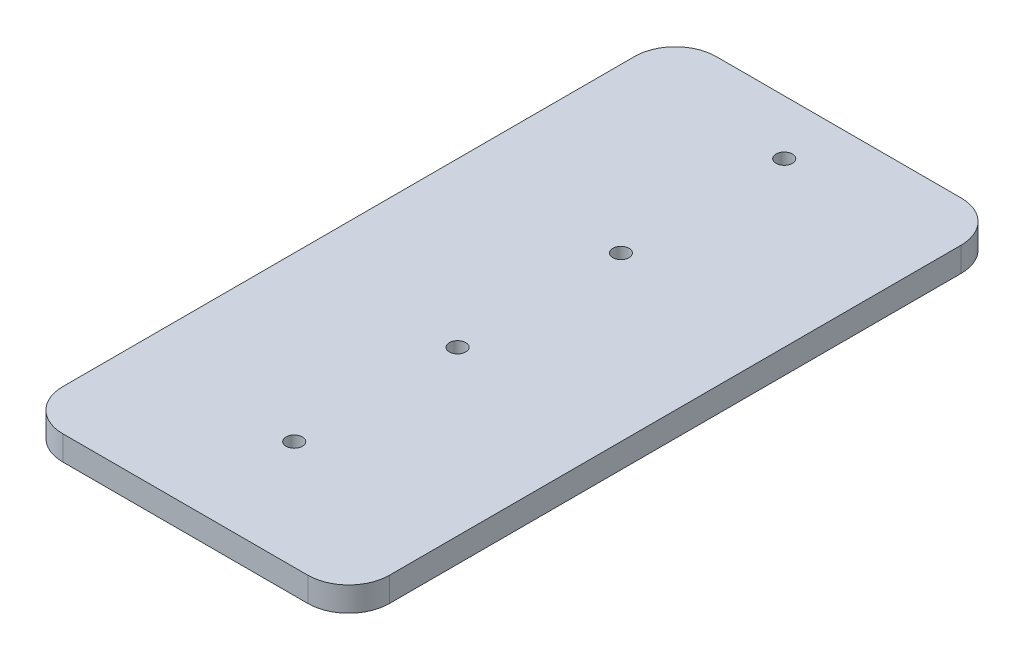
ISO-10303-21;
HEADER;
FILE_DESCRIPTION(('STEP AP214'),'2;1');
FILE_NAME('part.step','',(''),(''),'','','');
FILE_SCHEMA(('AUTOMOTIVE_DESIGN { 1 0 10303 214 1 1 1 1 }'));
ENDSEC;
DATA;
#1=APPLICATION_CONTEXT('core data for automotive mechanical design processes');
#2=APPLICATION_PROTOCOL_DEFINITION('international standard','automotive_design',2000,#1);
#3=PRODUCT_CONTEXT('',#1,'mechanical');
#4=PRODUCT('Part','Part','',(#3));
#5=PRODUCT_RELATED_PRODUCT_CATEGORY('part','',(#4));
#6=PRODUCT_DEFINITION_FORMATION('','',#4);
#7=PRODUCT_DEFINITION_CONTEXT('part definition',#1,'design');
#8=PRODUCT_DEFINITION('design','',#6,#7);
#9=PRODUCT_DEFINITION_SHAPE('','',#8);
#10=(LENGTH_UNIT() NAMED_UNIT(*) SI_UNIT(.MILLI.,.METRE.));
#11=(NAMED_UNIT(*) PLANE_ANGLE_UNIT() SI_UNIT($,.RADIAN.));
#12=(NAMED_UNIT(*) SI_UNIT($,.STERADIAN.) SOLID_ANGLE_UNIT());
#13=UNCERTAINTY_MEASURE_WITH_UNIT(LENGTH_MEASURE(1.E-05),#10,'distance_accuracy_value','');
#14=(GEOMETRIC_REPRESENTATION_CONTEXT(3) GLOBAL_UNCERTAINTY_ASSIGNED_CONTEXT((#13)) GLOBAL_UNIT_ASSIGNED_CONTEXT((#10,
#11,#12)) REPRESENTATION_CONTEXT('',''));
#15=CARTESIAN_POINT('',(0.,0.,0.));
#16=DIRECTION('',(0.,0.,1.));
#17=DIRECTION('',(1.,0.,0.));
#18=AXIS2_PLACEMENT_3D('',#15,#16,#17);
#19=CARTESIAN_POINT('',(-212.,25.5,501.828001486444));
#20=DIRECTION('',(0.,1.,0.));
#21=DIRECTION('',(0.,0.,1.));
#22=AXIS2_PLACEMENT_3D('',#19,#20,#21);
#23=PLANE('',#22);
#24=CARTESIAN_POINT('',(12.9999999999999,25.5,76.8280014864442));
#25=DIRECTION('',(0.,1.,0.));
#26=DIRECTION('',(0.,0.,1.));
#27=AXIS2_PLACEMENT_3D('',#24,#25,#26);
#28=CIRCLE('',#27,15.);
#29=CARTESIAN_POINT('',(12.9999999999999,25.5,91.8280014864441));
#30=VERTEX_POINT('',#29);
#31=EDGE_CURVE('E220',#30,#30,#28,.T.);
#32=ORIENTED_EDGE('',*,*,#31,.F.);
#33=EDGE_LOOP('',(#32));
#34=FACE_BOUND('',#33,.T.);
#35=CARTESIAN_POINT('',(12.9999999999999,25.5,-523.171998513556));
#36=DIRECTION('',(0.,1.,0.));
#37=DIRECTION('',(0.,0.,1.));
#38=AXIS2_PLACEMENT_3D('',#35,#36,#37);
#39=CIRCLE('',#38,15.);
#40=CARTESIAN_POINT('',(12.9999999999999,25.5,-508.171998513556));
#41=VERTEX_POINT('',#40);
#42=EDGE_CURVE('E146',#41,#41,#39,.T.);
#43=ORIENTED_EDGE('',*,*,#42,.F.);
#44=EDGE_LOOP('',(#43));
#45=FACE_BOUND('',#44,.T.);
#46=CARTESIAN_POINT('',(-212.,25.5,501.828001486444));
#47=DIRECTION('',(0.,1.,0.));
#48=DIRECTION('',(0.,0.,1.));
#49=AXIS2_PLACEMENT_3D('',#46,#47,#48);
#50=CIRCLE('',#49,75.);
#51=CARTESIAN_POINT('',(-287.,25.5,501.828001486444));
#52=VERTEX_POINT('',#51);
#53=CARTESIAN_POINT('',(-211.999999999999,25.5,576.828001486444));
#54=VERTEX_POINT('',#53);
#55=EDGE_CURVE('E166',#52,#54,#50,.T.);
#56=ORIENTED_EDGE('',*,*,#55,.T.);
#57=DIRECTION('',(1.,0.,0.));
#58=VECTOR('',#57,1.);
#59=CARTESIAN_POINT('',(-211.999999999999,25.5,576.828001486444));
#60=LINE('',#59,#58);
#61=CARTESIAN_POINT('',(237.999999999999,25.5,576.828001486444));
#62=VERTEX_POINT('',#61);
#63=EDGE_CURVE('E97',#54,#62,#60,.T.);
#64=ORIENTED_EDGE('',*,*,#63,.T.);
#65=CARTESIAN_POINT('',(238.,25.5,501.828001486444));
#66=DIRECTION('',(0.,1.,0.));
#67=DIRECTION('',(0.,0.,1.));
#68=AXIS2_PLACEMENT_3D('',#65,#66,#67);
#69=CIRCLE('',#68,75.);
#70=CARTESIAN_POINT('',(313.,25.5,501.828001486444));
#71=VERTEX_POINT('',#70);
#72=EDGE_CURVE('E187',#62,#71,#69,.T.);
#73=ORIENTED_EDGE('',*,*,#72,.T.);
#74=DIRECTION('',(0.,0.,-1.));
#75=VECTOR('',#74,1.);
#76=CARTESIAN_POINT('',(313.,25.5,501.828001486444));
#77=LINE('',#76,#75);
#78=CARTESIAN_POINT('',(313.,25.5,-548.171998513555));
#79=VERTEX_POINT('',#78);
#80=EDGE_CURVE('E198',#71,#79,#77,.T.);
#81=ORIENTED_EDGE('',*,*,#80,.T.);
#82=CARTESIAN_POINT('',(238.,25.5,-548.171998513556));
#83=DIRECTION('',(0.,1.,0.));
#84=DIRECTION('',(0.,0.,1.));
#85=AXIS2_PLACEMENT_3D('',#82,#83,#84);
#86=CIRCLE('',#85,75.);
#87=CARTESIAN_POINT('',(237.999999999999,25.5,-623.171998513556));
#88=VERTEX_POINT('',#87);
#89=EDGE_CURVE('E117',#79,#88,#86,.T.);
#90=ORIENTED_EDGE('',*,*,#89,.T.);
#91=DIRECTION('',(-1.,0.,0.));
#92=VECTOR('',#91,1.);
#93=CARTESIAN_POINT('',(-212.,25.5,-623.171998513556));
#94=LINE('',#93,#92);
#95=CARTESIAN_POINT('',(-212.,25.5,-623.171998513556));
#96=VERTEX_POINT('',#95);
#97=EDGE_CURVE('E110',#88,#96,#94,.T.);
#98=ORIENTED_EDGE('',*,*,#97,.T.);
#99=CARTESIAN_POINT('',(-212.,25.5,-548.171998513556));
#100=DIRECTION('',(0.,1.,0.));
#101=DIRECTION('',(0.,0.,-1.));
#102=AXIS2_PLACEMENT_3D('',#99,#100,#101);
#103=CIRCLE('',#102,75.);
#104=CARTESIAN_POINT('',(-287.,25.5,-548.171998513555));
#105=VERTEX_POINT('',#104);
#106=EDGE_CURVE('E114',#96,#105,#103,.T.);
#107=ORIENTED_EDGE('',*,*,#106,.T.);
#108=DIRECTION('',(0.,0.,1.));
#109=VECTOR('',#108,1.);
#110=CARTESIAN_POINT('',(-287.,25.5,-548.171998513555));
#111=LINE('',#110,#109);
#112=EDGE_CURVE('E56',#105,#52,#111,.T.);
#113=ORIENTED_EDGE('',*,*,#112,.T.);
#114=EDGE_LOOP('',(#56,#64,#73,#81,#90,#98,#107,#113));
#115=FACE_BOUND('',#114,.T.);
#116=CARTESIAN_POINT('',(12.9999999999999,25.5,-223.171998513556));
#117=DIRECTION('',(0.,1.,0.));
#118=DIRECTION('',(0.,0.,1.));
#119=AXIS2_PLACEMENT_3D('',#116,#117,#118);
#120=CIRCLE('',#119,15.);
#121=CARTESIAN_POINT('',(12.9999999999999,25.5,-208.171998513556));
#122=VERTEX_POINT('',#121);
#123=EDGE_CURVE('E212',#122,#122,#120,.T.);
#124=ORIENTED_EDGE('',*,*,#123,.F.);
#125=EDGE_LOOP('',(#124));
#126=FACE_BOUND('',#125,.T.);
#127=CARTESIAN_POINT('',(13.,25.5,376.828001486444));
#128=DIRECTION('',(0.,1.,0.));
#129=DIRECTION('',(0.,0.,1.));
#130=AXIS2_PLACEMENT_3D('',#127,#128,#129);
#131=CIRCLE('',#130,15.);
#132=CARTESIAN_POINT('',(13.,25.5,391.828001486444));
#133=VERTEX_POINT('',#132);
#134=EDGE_CURVE('E228',#133,#133,#131,.T.);
#135=ORIENTED_EDGE('',*,*,#134,.F.);
#136=EDGE_LOOP('',(#135));
#137=FACE_BOUND('',#136,.T.);
#138=ADVANCED_FACE('F38',(#34,#45,#115,#126,#137),#23,.T.);
#139=CARTESIAN_POINT('',(-212.,-19.5,501.828001486444));
#140=DIRECTION('',(0.,1.,0.));
#141=DIRECTION('',(0.,0.,1.));
#142=AXIS2_PLACEMENT_3D('',#139,#140,#141);
#143=PLANE('',#142);
#144=CARTESIAN_POINT('',(-212.,-19.5,501.828001486444));
#145=DIRECTION('',(0.,1.,0.));
#146=DIRECTION('',(0.,0.,1.));
#147=AXIS2_PLACEMENT_3D('',#144,#145,#146);
#148=CIRCLE('',#147,75.);
#149=CARTESIAN_POINT('',(-287.,-19.5,501.828001486444));
#150=VERTEX_POINT('',#149);
#151=CARTESIAN_POINT('',(-211.999999999999,-19.5,576.828001486444));
#152=VERTEX_POINT('',#151);
#153=EDGE_CURVE('E141',#150,#152,#148,.T.);
#154=ORIENTED_EDGE('',*,*,#153,.F.);
#155=DIRECTION('',(0.,0.,1.));
#156=VECTOR('',#155,1.);
#157=CARTESIAN_POINT('',(-287.,-19.5,351.828001486444));
#158=LINE('',#157,#156);
#159=CARTESIAN_POINT('',(-287.,-19.5,-548.171998513555));
#160=VERTEX_POINT('',#159);
#161=EDGE_CURVE('E85',#160,#150,#158,.T.);
#162=ORIENTED_EDGE('',*,*,#161,.F.);
#163=CARTESIAN_POINT('',(-212.,-19.5,-548.171998513556));
#164=DIRECTION('',(0.,1.,0.));
#165=DIRECTION('',(0.,0.,-1.));
#166=AXIS2_PLACEMENT_3D('',#163,#164,#165);
#167=CIRCLE('',#166,75.);
#168=CARTESIAN_POINT('',(-212.,-19.5,-623.171998513556));
#169=VERTEX_POINT('',#168);
#170=EDGE_CURVE('E161',#169,#160,#167,.T.);
#171=ORIENTED_EDGE('',*,*,#170,.F.);
#172=DIRECTION('',(-1.,0.,0.));
#173=VECTOR('',#172,1.);
#174=CARTESIAN_POINT('',(-212.,-19.5,-623.171998513556));
#175=LINE('',#174,#173);
#176=CARTESIAN_POINT('',(237.999999999999,-19.5,-623.171998513556));
#177=VERTEX_POINT('',#176);
#178=EDGE_CURVE('E127',#177,#169,#175,.T.);
#179=ORIENTED_EDGE('',*,*,#178,.F.);
#180=CARTESIAN_POINT('',(238.,-19.5,-548.171998513556));
#181=DIRECTION('',(0.,1.,0.));
#182=DIRECTION('',(0.,0.,1.));
#183=AXIS2_PLACEMENT_3D('',#180,#181,#182);
#184=CIRCLE('',#183,75.);
#185=CARTESIAN_POINT('',(313.,-19.5,-548.171998513555));
#186=VERTEX_POINT('',#185);
#187=EDGE_CURVE('E156',#186,#177,#184,.T.);
#188=ORIENTED_EDGE('',*,*,#187,.F.);
#189=DIRECTION('',(0.,0.,-1.));
#190=VECTOR('',#189,1.);
#191=CARTESIAN_POINT('',(313.,-19.5,-548.171998513555));
#192=LINE('',#191,#190);
#193=CARTESIAN_POINT('',(313.,-19.5,501.828001486444));
#194=VERTEX_POINT('',#193);
#195=EDGE_CURVE('E153',#194,#186,#192,.T.);
#196=ORIENTED_EDGE('',*,*,#195,.F.);
#197=CARTESIAN_POINT('',(238.,-19.5,501.828001486444));
#198=DIRECTION('',(0.,1.,0.));
#199=DIRECTION('',(0.,0.,1.));
#200=AXIS2_PLACEMENT_3D('',#197,#198,#199);
#201=CIRCLE('',#200,75.);
#202=CARTESIAN_POINT('',(237.999999999999,-19.5,576.828001486444));
#203=VERTEX_POINT('',#202);
#204=EDGE_CURVE('E149',#203,#194,#201,.T.);
#205=ORIENTED_EDGE('',*,*,#204,.F.);
#206=DIRECTION('',(1.,0.,0.));
#207=VECTOR('',#206,1.);
#208=CARTESIAN_POINT('',(-211.999999999999,-19.5,576.828001486444));
#209=LINE('',#208,#207);
#210=EDGE_CURVE('E145',#152,#203,#209,.T.);
#211=ORIENTED_EDGE('',*,*,#210,.F.);
#212=EDGE_LOOP('',(#154,#162,#171,#179,#188,#196,#205,#211));
#213=FACE_BOUND('',#212,.T.);
#214=CARTESIAN_POINT('',(12.9999999999999,-19.5,-523.171998513556));
#215=DIRECTION('',(0.,1.,0.));
#216=DIRECTION('',(0.,0.,1.));
#217=AXIS2_PLACEMENT_3D('',#214,#215,#216);
#218=CIRCLE('',#217,15.);
#219=CARTESIAN_POINT('',(12.9999999999999,-19.5,-508.171998513556));
#220=VERTEX_POINT('',#219);
#221=EDGE_CURVE('E208',#220,#220,#218,.T.);
#222=ORIENTED_EDGE('',*,*,#221,.T.);
#223=EDGE_LOOP('',(#222));
#224=FACE_BOUND('',#223,.T.);
#225=CARTESIAN_POINT('',(12.9999999999999,-19.5,-223.171998513556));
#226=DIRECTION('',(0.,1.,0.));
#227=DIRECTION('',(0.,0.,1.));
#228=AXIS2_PLACEMENT_3D('',#225,#226,#227);
#229=CIRCLE('',#228,15.);
#230=CARTESIAN_POINT('',(12.9999999999999,-19.5,-208.171998513556));
#231=VERTEX_POINT('',#230);
#232=EDGE_CURVE('E216',#231,#231,#229,.T.);
#233=ORIENTED_EDGE('',*,*,#232,.T.);
#234=EDGE_LOOP('',(#233));
#235=FACE_BOUND('',#234,.T.);
#236=CARTESIAN_POINT('',(12.9999999999999,-19.5,76.8280014864442));
#237=DIRECTION('',(0.,1.,0.));
#238=DIRECTION('',(0.,0.,1.));
#239=AXIS2_PLACEMENT_3D('',#236,#237,#238);
#240=CIRCLE('',#239,15.);
#241=CARTESIAN_POINT('',(12.9999999999999,-19.5,91.8280014864441));
#242=VERTEX_POINT('',#241);
#243=EDGE_CURVE('E224',#242,#242,#240,.T.);
#244=ORIENTED_EDGE('',*,*,#243,.T.);
#245=EDGE_LOOP('',(#244));
#246=FACE_BOUND('',#245,.T.);
#247=CARTESIAN_POINT('',(13.,-19.5,376.828001486444));
#248=DIRECTION('',(0.,1.,0.));
#249=DIRECTION('',(0.,0.,1.));
#250=AXIS2_PLACEMENT_3D('',#247,#248,#249);
#251=CIRCLE('',#250,15.);
#252=CARTESIAN_POINT('',(13.,-19.5,391.828001486444));
#253=VERTEX_POINT('',#252);
#254=EDGE_CURVE('E232',#253,#253,#251,.T.);
#255=ORIENTED_EDGE('',*,*,#254,.T.);
#256=EDGE_LOOP('',(#255));
#257=FACE_BOUND('',#256,.T.);
#258=ADVANCED_FACE('F188',(#213,#224,#235,#246,#257),#143,.F.);
#259=CARTESIAN_POINT('',(-212.,25.5,501.828001486444));
#260=DIRECTION('',(0.,-1.,0.));
#261=DIRECTION('',(0.,0.,-1.));
#262=AXIS2_PLACEMENT_3D('',#259,#260,#261);
#263=CYLINDRICAL_SURFACE('',#262,75.);
#264=ORIENTED_EDGE('',*,*,#153,.T.);
#265=DIRECTION('',(0.,-1.,0.));
#266=VECTOR('',#265,1.);
#267=CARTESIAN_POINT('',(-211.999999999999,25.5,576.828001486444));
#268=LINE('',#267,#266);
#269=EDGE_CURVE('E11',#54,#152,#268,.T.);
#270=ORIENTED_EDGE('',*,*,#269,.F.);
#271=ORIENTED_EDGE('',*,*,#55,.F.);
#272=DIRECTION('',(0.,-1.,0.));
#273=VECTOR('',#272,1.);
#274=CARTESIAN_POINT('',(-287.,25.5,501.828001486444));
#275=LINE('',#274,#273);
#276=EDGE_CURVE('E137',#52,#150,#275,.T.);
#277=ORIENTED_EDGE('',*,*,#276,.T.);
#278=EDGE_LOOP('',(#264,#270,#271,#277));
#279=FACE_BOUND('',#278,.T.);
#280=ADVANCED_FACE('F40',(#279),#263,.T.);
#281=CARTESIAN_POINT('',(-211.999999999999,25.5,576.828001486444));
#282=DIRECTION('',(0.,0.,-1.));
#283=DIRECTION('',(-1.,0.,0.));
#284=AXIS2_PLACEMENT_3D('',#281,#282,#283);
#285=PLANE('',#284);
#286=ORIENTED_EDGE('',*,*,#210,.T.);
#287=DIRECTION('',(0.,-1.,0.));
#288=VECTOR('',#287,1.);
#289=CARTESIAN_POINT('',(237.999999999999,25.5,576.828001486444));
#290=LINE('',#289,#288);
#291=EDGE_CURVE('E48',#62,#203,#290,.T.);
#292=ORIENTED_EDGE('',*,*,#291,.F.);
#293=ORIENTED_EDGE('',*,*,#63,.F.);
#294=ORIENTED_EDGE('',*,*,#269,.T.);
#295=EDGE_LOOP('',(#286,#292,#293,#294));
#296=FACE_BOUND('',#295,.T.);
#297=ADVANCED_FACE('F268',(#296),#285,.F.);
#298=CARTESIAN_POINT('',(238.,25.5,501.828001486444));
#299=DIRECTION('',(0.,-1.,0.));
#300=DIRECTION('',(0.,0.,-1.));
#301=AXIS2_PLACEMENT_3D('',#298,#299,#300);
#302=CYLINDRICAL_SURFACE('',#301,75.);
#303=ORIENTED_EDGE('',*,*,#204,.T.);
#304=DIRECTION('',(0.,-1.,0.));
#305=VECTOR('',#304,1.);
#306=CARTESIAN_POINT('',(313.,25.5,501.828001486444));
#307=LINE('',#306,#305);
#308=EDGE_CURVE('E177',#71,#194,#307,.T.);
#309=ORIENTED_EDGE('',*,*,#308,.F.);
#310=ORIENTED_EDGE('',*,*,#72,.F.);
#311=ORIENTED_EDGE('',*,*,#291,.T.);
#312=EDGE_LOOP('',(#303,#309,#310,#311));
#313=FACE_BOUND('',#312,.T.);
#314=ADVANCED_FACE('F185',(#313),#302,.T.);
#315=CARTESIAN_POINT('',(313.,25.5,-548.171998513555));
#316=DIRECTION('',(-1.,0.,0.));
#317=DIRECTION('',(0.,0.,1.));
#318=AXIS2_PLACEMENT_3D('',#315,#316,#317);
#319=PLANE('',#318);
#320=ORIENTED_EDGE('',*,*,#195,.T.);
#321=DIRECTION('',(0.,-1.,0.));
#322=VECTOR('',#321,1.);
#323=CARTESIAN_POINT('',(313.,25.5,-548.171998513555));
#324=LINE('',#323,#322);
#325=EDGE_CURVE('E173',#79,#186,#324,.T.);
#326=ORIENTED_EDGE('',*,*,#325,.F.);
#327=ORIENTED_EDGE('',*,*,#80,.F.);
#328=ORIENTED_EDGE('',*,*,#308,.T.);
#329=EDGE_LOOP('',(#320,#326,#327,#328));
#330=FACE_BOUND('',#329,.T.);
#331=ADVANCED_FACE('F193',(#330),#319,.F.);
#332=CARTESIAN_POINT('',(238.,25.5,-548.171998513556));
#333=DIRECTION('',(0.,-1.,0.));
#334=DIRECTION('',(0.,0.,-1.));
#335=AXIS2_PLACEMENT_3D('',#332,#333,#334);
#336=CYLINDRICAL_SURFACE('',#335,75.);
#337=ORIENTED_EDGE('',*,*,#187,.T.);
#338=DIRECTION('',(0.,-1.,0.));
#339=VECTOR('',#338,1.);
#340=CARTESIAN_POINT('',(237.999999999999,25.5,-623.171998513556));
#341=LINE('',#340,#339);
#342=EDGE_CURVE('E130',#88,#177,#341,.T.);
#343=ORIENTED_EDGE('',*,*,#342,.F.);
#344=ORIENTED_EDGE('',*,*,#89,.F.);
#345=ORIENTED_EDGE('',*,*,#325,.T.);
#346=EDGE_LOOP('',(#337,#343,#344,#345));
#347=FACE_BOUND('',#346,.T.);
#348=ADVANCED_FACE('F196',(#347),#336,.T.);
#349=CARTESIAN_POINT('',(-212.,25.5,-623.171998513556));
#350=DIRECTION('',(0.,0.,1.));
#351=DIRECTION('',(1.,0.,0.));
#352=AXIS2_PLACEMENT_3D('',#349,#350,#351);
#353=PLANE('',#352);
#354=ORIENTED_EDGE('',*,*,#178,.T.);
#355=DIRECTION('',(0.,-1.,0.));
#356=VECTOR('',#355,1.);
#357=CARTESIAN_POINT('',(-212.,25.5,-623.171998513556));
#358=LINE('',#357,#356);
#359=EDGE_CURVE('E124',#96,#169,#358,.T.);
#360=ORIENTED_EDGE('',*,*,#359,.F.);
#361=ORIENTED_EDGE('',*,*,#97,.F.);
#362=ORIENTED_EDGE('',*,*,#342,.T.);
#363=EDGE_LOOP('',(#354,#360,#361,#362));
#364=FACE_BOUND('',#363,.T.);
#365=ADVANCED_FACE('F125',(#364),#353,.F.);
#366=CARTESIAN_POINT('',(-212.,25.5,-548.171998513556));
#367=DIRECTION('',(0.,-1.,0.));
#368=DIRECTION('',(0.,0.,-1.));
#369=AXIS2_PLACEMENT_3D('',#366,#367,#368);
#370=CYLINDRICAL_SURFACE('',#369,75.);
#371=ORIENTED_EDGE('',*,*,#170,.T.);
#372=DIRECTION('',(0.,-1.,0.));
#373=VECTOR('',#372,1.);
#374=CARTESIAN_POINT('',(-287.,25.5,-548.171998513555));
#375=LINE('',#374,#373);
#376=EDGE_CURVE('E131',#105,#160,#375,.T.);
#377=ORIENTED_EDGE('',*,*,#376,.F.);
#378=ORIENTED_EDGE('',*,*,#106,.F.);
#379=ORIENTED_EDGE('',*,*,#359,.T.);
#380=EDGE_LOOP('',(#371,#377,#378,#379));
#381=FACE_BOUND('',#380,.T.);
#382=ADVANCED_FACE('F133',(#381),#370,.T.);
#383=CARTESIAN_POINT('',(-287.,25.5,351.828001486444));
#384=DIRECTION('',(1.,0.,0.));
#385=DIRECTION('',(0.,0.,-1.));
#386=AXIS2_PLACEMENT_3D('',#383,#384,#385);
#387=PLANE('',#386);
#388=ORIENTED_EDGE('',*,*,#161,.T.);
#389=ORIENTED_EDGE('',*,*,#276,.F.);
#390=ORIENTED_EDGE('',*,*,#112,.F.);
#391=ORIENTED_EDGE('',*,*,#376,.T.);
#392=EDGE_LOOP('',(#388,#389,#390,#391));
#393=FACE_BOUND('',#392,.T.);
#394=ADVANCED_FACE('F256',(#393),#387,.F.);
#395=CARTESIAN_POINT('',(12.9999999999999,25.5,-523.171998513556));
#396=DIRECTION('',(0.,-1.,0.));
#397=DIRECTION('',(0.,0.,-1.));
#398=AXIS2_PLACEMENT_3D('',#395,#396,#397);
#399=CYLINDRICAL_SURFACE('',#398,15.);
#400=ORIENTED_EDGE('',*,*,#42,.T.);
#401=EDGE_LOOP('',(#400));
#402=FACE_BOUND('',#401,.T.);
#403=ORIENTED_EDGE('',*,*,#221,.F.);
#404=EDGE_LOOP('',(#403));
#405=FACE_BOUND('',#404,.T.);
#406=ADVANCED_FACE('F253',(#402,#405),#399,.F.);
#407=CARTESIAN_POINT('',(12.9999999999999,25.5,-223.171998513556));
#408=DIRECTION('',(0.,-1.,0.));
#409=DIRECTION('',(0.,0.,-1.));
#410=AXIS2_PLACEMENT_3D('',#407,#408,#409);
#411=CYLINDRICAL_SURFACE('',#410,15.);
#412=ORIENTED_EDGE('',*,*,#123,.T.);
#413=EDGE_LOOP('',(#412));
#414=FACE_BOUND('',#413,.T.);
#415=ORIENTED_EDGE('',*,*,#232,.F.);
#416=EDGE_LOOP('',(#415));
#417=FACE_BOUND('',#416,.T.);
#418=ADVANCED_FACE('F338',(#414,#417),#411,.F.);
#419=CARTESIAN_POINT('',(12.9999999999999,25.5,76.8280014864442));
#420=DIRECTION('',(0.,-1.,0.));
#421=DIRECTION('',(0.,0.,-1.));
#422=AXIS2_PLACEMENT_3D('',#419,#420,#421);
#423=CYLINDRICAL_SURFACE('',#422,15.);
#424=ORIENTED_EDGE('',*,*,#31,.T.);
#425=EDGE_LOOP('',(#424));
#426=FACE_BOUND('',#425,.T.);
#427=ORIENTED_EDGE('',*,*,#243,.F.);
#428=EDGE_LOOP('',(#427));
#429=FACE_BOUND('',#428,.T.);
#430=ADVANCED_FACE('F346',(#426,#429),#423,.F.);
#431=CARTESIAN_POINT('',(13.,25.5,376.828001486444));
#432=DIRECTION('',(0.,-1.,0.));
#433=DIRECTION('',(0.,0.,-1.));
#434=AXIS2_PLACEMENT_3D('',#431,#432,#433);
#435=CYLINDRICAL_SURFACE('',#434,15.);
#436=ORIENTED_EDGE('',*,*,#134,.T.);
#437=EDGE_LOOP('',(#436));
#438=FACE_BOUND('',#437,.T.);
#439=ORIENTED_EDGE('',*,*,#254,.F.);
#440=EDGE_LOOP('',(#439));
#441=FACE_BOUND('',#440,.T.);
#442=ADVANCED_FACE('F240',(#438,#441),#435,.F.);
#443=CLOSED_SHELL('',(#138,#258,#280,#297,#314,#331,#348,#365,#382,#394,#406,#418,#430,#442));
#444=MANIFOLD_SOLID_BREP('B2',#443);
#445=ADVANCED_BREP_SHAPE_REPRESENTATION('',(#18,#444),#14);
#446=SHAPE_DEFINITION_REPRESENTATION(#9,#445);
ENDSEC;
END-ISO-10303-21;
